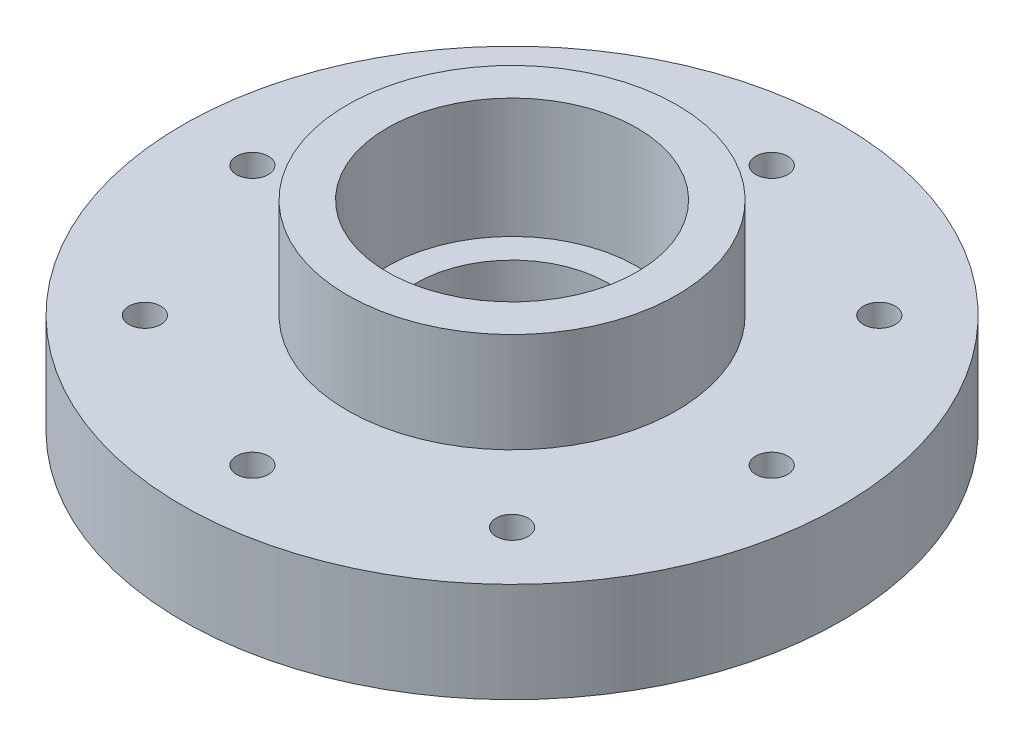
ISO-10303-21;
HEADER;
FILE_DESCRIPTION(('STEP AP214'),'2;1');
FILE_NAME('part.step','',(''),(''),'','','');
FILE_SCHEMA(('AUTOMOTIVE_DESIGN { 1 0 10303 214 1 1 1 1 }'));
ENDSEC;
DATA;
#1=APPLICATION_CONTEXT('core data for automotive mechanical design processes');
#2=APPLICATION_PROTOCOL_DEFINITION('international standard','automotive_design',2000,#1);
#3=PRODUCT_CONTEXT('',#1,'mechanical');
#4=PRODUCT('Part','Part','',(#3));
#5=PRODUCT_RELATED_PRODUCT_CATEGORY('part','',(#4));
#6=PRODUCT_DEFINITION_FORMATION('','',#4);
#7=PRODUCT_DEFINITION_CONTEXT('part definition',#1,'design');
#8=PRODUCT_DEFINITION('design','',#6,#7);
#9=PRODUCT_DEFINITION_SHAPE('','',#8);
#10=(LENGTH_UNIT() NAMED_UNIT(*) SI_UNIT(.MILLI.,.METRE.));
#11=(NAMED_UNIT(*) PLANE_ANGLE_UNIT() SI_UNIT($,.RADIAN.));
#12=(NAMED_UNIT(*) SI_UNIT($,.STERADIAN.) SOLID_ANGLE_UNIT());
#13=UNCERTAINTY_MEASURE_WITH_UNIT(LENGTH_MEASURE(1.E-05),#10,'distance_accuracy_value','');
#14=(GEOMETRIC_REPRESENTATION_CONTEXT(3) GLOBAL_UNCERTAINTY_ASSIGNED_CONTEXT((#13)) GLOBAL_UNIT_ASSIGNED_CONTEXT((#10,
#11,#12)) REPRESENTATION_CONTEXT('',''));
#15=CARTESIAN_POINT('',(0.,0.,0.));
#16=DIRECTION('',(0.,0.,1.));
#17=DIRECTION('',(1.,0.,0.));
#18=AXIS2_PLACEMENT_3D('',#15,#16,#17);
#19=CARTESIAN_POINT('',(0.,0.,0.));
#20=DIRECTION('',(0.,-1.,0.));
#21=DIRECTION('',(0.,0.,-1.));
#22=AXIS2_PLACEMENT_3D('',#19,#20,#21);
#23=CYLINDRICAL_SURFACE('',#22,82.5);
#24=CARTESIAN_POINT('',(0.,25.,0.));
#25=DIRECTION('',(0.,-1.,0.));
#26=DIRECTION('',(0.,0.,-1.));
#27=AXIS2_PLACEMENT_3D('',#24,#25,#26);
#28=CIRCLE('',#27,82.5);
#29=CARTESIAN_POINT('',(0.,25.,-82.5));
#30=VERTEX_POINT('',#29);
#31=EDGE_CURVE('E70',#30,#30,#28,.T.);
#32=ORIENTED_EDGE('',*,*,#31,.T.);
#33=EDGE_LOOP('',(#32));
#34=FACE_BOUND('',#33,.T.);
#35=CARTESIAN_POINT('',(0.,0.,0.));
#36=DIRECTION('',(0.,-1.,0.));
#37=DIRECTION('',(0.,0.,-1.));
#38=AXIS2_PLACEMENT_3D('',#35,#36,#37);
#39=CIRCLE('',#38,82.5);
#40=CARTESIAN_POINT('',(0.,0.,-82.5));
#41=VERTEX_POINT('',#40);
#42=EDGE_CURVE('E10',#41,#41,#39,.T.);
#43=ORIENTED_EDGE('',*,*,#42,.F.);
#44=EDGE_LOOP('',(#43));
#45=FACE_BOUND('',#44,.T.);
#46=ADVANCED_FACE('F31',(#34,#45),#23,.T.);
#47=CARTESIAN_POINT('',(82.5,0.,0.));
#48=DIRECTION('',(0.,-1.,0.));
#49=DIRECTION('',(0.,0.,-1.));
#50=AXIS2_PLACEMENT_3D('',#47,#48,#49);
#51=PLANE('',#50);
#52=CARTESIAN_POINT('',(65.,0.,0.));
#53=DIRECTION('',(0.,-1.,0.));
#54=DIRECTION('',(0.,0.,-1.));
#55=AXIS2_PLACEMENT_3D('',#52,#53,#54);
#56=CIRCLE('',#55,4.00000000000001);
#57=CARTESIAN_POINT('',(65.,0.,-4.00000000000004));
#58=VERTEX_POINT('',#57);
#59=EDGE_CURVE('E51',#58,#58,#56,.T.);
#60=ORIENTED_EDGE('',*,*,#59,.F.);
#61=EDGE_LOOP('',(#60));
#62=FACE_BOUND('',#61,.T.);
#63=CARTESIAN_POINT('',(45.9619407771261,0.,-45.961940777125));
#64=DIRECTION('',(0.,-1.,0.));
#65=DIRECTION('',(0.,0.,-1.));
#66=AXIS2_PLACEMENT_3D('',#63,#64,#65);
#67=CIRCLE('',#66,3.99999999999921);
#68=CARTESIAN_POINT('',(45.9619407771261,0.,-49.9619407771242));
#69=VERTEX_POINT('',#68);
#70=EDGE_CURVE('E291',#69,#69,#67,.T.);
#71=ORIENTED_EDGE('',*,*,#70,.F.);
#72=EDGE_LOOP('',(#71));
#73=FACE_BOUND('',#72,.T.);
#74=CARTESIAN_POINT('',(6.93889390390723E-13,0.,-65.));
#75=DIRECTION('',(0.,-1.,0.));
#76=DIRECTION('',(0.,0.,-1.));
#77=AXIS2_PLACEMENT_3D('',#74,#75,#76);
#78=CIRCLE('',#77,3.99999999999913);
#79=CARTESIAN_POINT('',(6.93889390390723E-13,0.,-68.9999999999991));
#80=VERTEX_POINT('',#79);
#81=EDGE_CURVE('E294',#80,#80,#78,.T.);
#82=ORIENTED_EDGE('',*,*,#81,.F.);
#83=EDGE_LOOP('',(#82));
#84=FACE_BOUND('',#83,.T.);
#85=CARTESIAN_POINT('',(-45.9619407771252,0.,-45.961940777126));
#86=DIRECTION('',(0.,-1.,0.));
#87=DIRECTION('',(0.,0.,-1.));
#88=AXIS2_PLACEMENT_3D('',#85,#86,#87);
#89=CIRCLE('',#88,3.99999999999956);
#90=CARTESIAN_POINT('',(-45.9619407771252,0.,-49.9619407771255));
#91=VERTEX_POINT('',#90);
#92=EDGE_CURVE('E299',#91,#91,#89,.T.);
#93=ORIENTED_EDGE('',*,*,#92,.F.);
#94=EDGE_LOOP('',(#93));
#95=FACE_BOUND('',#94,.T.);
#96=CARTESIAN_POINT('',(-65.,0.,0.));
#97=DIRECTION('',(0.,-1.,0.));
#98=DIRECTION('',(0.,0.,-1.));
#99=AXIS2_PLACEMENT_3D('',#96,#97,#98);
#100=CIRCLE('',#99,4.00000000000001);
#101=CARTESIAN_POINT('',(-65.,0.,-4.00000000000001));
#102=VERTEX_POINT('',#101);
#103=EDGE_CURVE('E302',#102,#102,#100,.T.);
#104=ORIENTED_EDGE('',*,*,#103,.F.);
#105=EDGE_LOOP('',(#104));
#106=FACE_BOUND('',#105,.T.);
#107=CARTESIAN_POINT('',(-45.9619407771252,0.,45.961940777126));
#108=DIRECTION('',(0.,-1.,0.));
#109=DIRECTION('',(0.,0.,-1.));
#110=AXIS2_PLACEMENT_3D('',#107,#108,#109);
#111=CIRCLE('',#110,4.00000000000002);
#112=CARTESIAN_POINT('',(-45.9619407771252,0.,41.961940777126));
#113=VERTEX_POINT('',#112);
#114=EDGE_CURVE('E305',#113,#113,#111,.T.);
#115=ORIENTED_EDGE('',*,*,#114,.F.);
#116=EDGE_LOOP('',(#115));
#117=FACE_BOUND('',#116,.T.);
#118=CARTESIAN_POINT('',(7.21644966006352E-13,0.,65.));
#119=DIRECTION('',(0.,-1.,0.));
#120=DIRECTION('',(0.,0.,-1.));
#121=AXIS2_PLACEMENT_3D('',#118,#119,#120);
#122=CIRCLE('',#121,4.00000000000002);
#123=CARTESIAN_POINT('',(7.21644966006352E-13,0.,61.));
#124=VERTEX_POINT('',#123);
#125=EDGE_CURVE('E307',#124,#124,#122,.T.);
#126=ORIENTED_EDGE('',*,*,#125,.F.);
#127=EDGE_LOOP('',(#126));
#128=FACE_BOUND('',#127,.T.);
#129=CARTESIAN_POINT('',(45.9619407771261,0.,45.961940777125));
#130=DIRECTION('',(0.,-1.,0.));
#131=DIRECTION('',(0.,0.,-1.));
#132=AXIS2_PLACEMENT_3D('',#129,#130,#131);
#133=CIRCLE('',#132,4.00000000000002);
#134=CARTESIAN_POINT('',(45.9619407771261,0.,41.961940777125));
#135=VERTEX_POINT('',#134);
#136=EDGE_CURVE('E82',#135,#135,#133,.T.);
#137=ORIENTED_EDGE('',*,*,#136,.F.);
#138=EDGE_LOOP('',(#137));
#139=FACE_BOUND('',#138,.T.);
#140=ORIENTED_EDGE('',*,*,#42,.T.);
#141=EDGE_LOOP('',(#140));
#142=FACE_BOUND('',#141,.T.);
#143=CARTESIAN_POINT('',(0.,0.,0.));
#144=DIRECTION('',(0.,-1.,0.));
#145=DIRECTION('',(0.,0.,-1.));
#146=AXIS2_PLACEMENT_3D('',#143,#144,#145);
#147=CIRCLE('',#146,56.);
#148=CARTESIAN_POINT('',(0.,0.,-56.));
#149=VERTEX_POINT('',#148);
#150=EDGE_CURVE('E38',#149,#149,#147,.T.);
#151=ORIENTED_EDGE('',*,*,#150,.F.);
#152=EDGE_LOOP('',(#151));
#153=FACE_BOUND('',#152,.T.);
#154=ADVANCED_FACE('F106',(#62,#73,#84,#95,#106,#117,#128,#139,#142,#153),#51,.T.);
#155=CARTESIAN_POINT('',(0.,0.,0.));
#156=DIRECTION('',(0.,-1.,0.));
#157=DIRECTION('',(0.,0.,-1.));
#158=AXIS2_PLACEMENT_3D('',#155,#156,#157);
#159=CYLINDRICAL_SURFACE('',#158,56.);
#160=ORIENTED_EDGE('',*,*,#150,.T.);
#161=EDGE_LOOP('',(#160));
#162=FACE_BOUND('',#161,.T.);
#163=CARTESIAN_POINT('',(0.,6.00000000000001,0.));
#164=DIRECTION('',(0.,-1.,0.));
#165=DIRECTION('',(0.,0.,-1.));
#166=AXIS2_PLACEMENT_3D('',#163,#164,#165);
#167=CIRCLE('',#166,56.);
#168=CARTESIAN_POINT('',(0.,6.00000000000001,-56.));
#169=VERTEX_POINT('',#168);
#170=EDGE_CURVE('E43',#169,#169,#167,.T.);
#171=ORIENTED_EDGE('',*,*,#170,.F.);
#172=EDGE_LOOP('',(#171));
#173=FACE_BOUND('',#172,.T.);
#174=ADVANCED_FACE('F104',(#162,#173),#159,.F.);
#175=CARTESIAN_POINT('',(56.,6.00000000000001,0.));
#176=DIRECTION('',(0.,-1.,0.));
#177=DIRECTION('',(0.,0.,-1.));
#178=AXIS2_PLACEMENT_3D('',#175,#176,#177);
#179=PLANE('',#178);
#180=ORIENTED_EDGE('',*,*,#170,.T.);
#181=EDGE_LOOP('',(#180));
#182=FACE_BOUND('',#181,.T.);
#183=CARTESIAN_POINT('',(0.,6.,0.));
#184=DIRECTION('',(0.,-1.,0.));
#185=DIRECTION('',(0.,0.,-1.));
#186=AXIS2_PLACEMENT_3D('',#183,#184,#185);
#187=CIRCLE('',#186,24.);
#188=CARTESIAN_POINT('',(0.,6.,-24.));
#189=VERTEX_POINT('',#188);
#190=EDGE_CURVE('E96',#189,#189,#187,.T.);
#191=ORIENTED_EDGE('',*,*,#190,.F.);
#192=EDGE_LOOP('',(#191));
#193=FACE_BOUND('',#192,.T.);
#194=ADVANCED_FACE('F101',(#182,#193),#179,.T.);
#195=CARTESIAN_POINT('',(0.,0.,0.));
#196=DIRECTION('',(0.,-1.,0.));
#197=DIRECTION('',(0.,0.,-1.));
#198=AXIS2_PLACEMENT_3D('',#195,#196,#197);
#199=CYLINDRICAL_SURFACE('',#198,24.);
#200=ORIENTED_EDGE('',*,*,#190,.T.);
#201=EDGE_LOOP('',(#200));
#202=FACE_BOUND('',#201,.T.);
#203=CARTESIAN_POINT('',(0.,20.,0.));
#204=DIRECTION('',(0.,-1.,0.));
#205=DIRECTION('',(0.,0.,-1.));
#206=AXIS2_PLACEMENT_3D('',#203,#204,#205);
#207=CIRCLE('',#206,24.);
#208=CARTESIAN_POINT('',(0.,20.,-24.));
#209=VERTEX_POINT('',#208);
#210=EDGE_CURVE('E93',#209,#209,#207,.T.);
#211=ORIENTED_EDGE('',*,*,#210,.F.);
#212=EDGE_LOOP('',(#211));
#213=FACE_BOUND('',#212,.T.);
#214=ADVANCED_FACE('F113',(#202,#213),#199,.F.);
#215=CARTESIAN_POINT('',(24.,20.,0.));
#216=DIRECTION('',(0.,1.,0.));
#217=DIRECTION('',(0.,0.,1.));
#218=AXIS2_PLACEMENT_3D('',#215,#216,#217);
#219=PLANE('',#218);
#220=ORIENTED_EDGE('',*,*,#210,.T.);
#221=EDGE_LOOP('',(#220));
#222=FACE_BOUND('',#221,.T.);
#223=CARTESIAN_POINT('',(0.,20.,0.));
#224=DIRECTION('',(0.,-1.,0.));
#225=DIRECTION('',(0.,0.,-1.));
#226=AXIS2_PLACEMENT_3D('',#223,#224,#225);
#227=CIRCLE('',#226,31.2564621680309);
#228=CARTESIAN_POINT('',(0.,20.,-31.2564621680309));
#229=VERTEX_POINT('',#228);
#230=EDGE_CURVE('E90',#229,#229,#227,.T.);
#231=ORIENTED_EDGE('',*,*,#230,.F.);
#232=EDGE_LOOP('',(#231));
#233=FACE_BOUND('',#232,.T.);
#234=ADVANCED_FACE('F234',(#222,#233),#219,.T.);
#235=CARTESIAN_POINT('',(0.,0.,0.));
#236=DIRECTION('',(0.,-1.,0.));
#237=DIRECTION('',(0.,0.,-1.));
#238=AXIS2_PLACEMENT_3D('',#235,#236,#237);
#239=CYLINDRICAL_SURFACE('',#238,31.2564621680309);
#240=ORIENTED_EDGE('',*,*,#230,.T.);
#241=EDGE_LOOP('',(#240));
#242=FACE_BOUND('',#241,.T.);
#243=CARTESIAN_POINT('',(0.,50.,0.));
#244=DIRECTION('',(0.,-1.,0.));
#245=DIRECTION('',(0.,0.,-1.));
#246=AXIS2_PLACEMENT_3D('',#243,#244,#245);
#247=CIRCLE('',#246,31.2564621680309);
#248=CARTESIAN_POINT('',(0.,50.,-31.2564621680309));
#249=VERTEX_POINT('',#248);
#250=EDGE_CURVE('E87',#249,#249,#247,.T.);
#251=ORIENTED_EDGE('',*,*,#250,.F.);
#252=EDGE_LOOP('',(#251));
#253=FACE_BOUND('',#252,.T.);
#254=ADVANCED_FACE('F230',(#242,#253),#239,.F.);
#255=CARTESIAN_POINT('',(31.2564621680309,50.,0.));
#256=DIRECTION('',(0.,1.,0.));
#257=DIRECTION('',(0.,0.,1.));
#258=AXIS2_PLACEMENT_3D('',#255,#256,#257);
#259=PLANE('',#258);
#260=ORIENTED_EDGE('',*,*,#250,.T.);
#261=EDGE_LOOP('',(#260));
#262=FACE_BOUND('',#261,.T.);
#263=CARTESIAN_POINT('',(0.,50.,0.));
#264=DIRECTION('',(0.,-1.,0.));
#265=DIRECTION('',(0.,0.,-1.));
#266=AXIS2_PLACEMENT_3D('',#263,#264,#265);
#267=CIRCLE('',#266,41.2564621680309);
#268=CARTESIAN_POINT('',(0.,50.,-41.2564621680309));
#269=VERTEX_POINT('',#268);
#270=EDGE_CURVE('E79',#269,#269,#267,.T.);
#271=ORIENTED_EDGE('',*,*,#270,.F.);
#272=EDGE_LOOP('',(#271));
#273=FACE_BOUND('',#272,.T.);
#274=ADVANCED_FACE('F226',(#262,#273),#259,.T.);
#275=CARTESIAN_POINT('',(0.,0.,0.));
#276=DIRECTION('',(0.,-1.,0.));
#277=DIRECTION('',(0.,0.,-1.));
#278=AXIS2_PLACEMENT_3D('',#275,#276,#277);
#279=CYLINDRICAL_SURFACE('',#278,41.2564621680309);
#280=ORIENTED_EDGE('',*,*,#270,.T.);
#281=EDGE_LOOP('',(#280));
#282=FACE_BOUND('',#281,.T.);
#283=CARTESIAN_POINT('',(0.,25.,0.));
#284=DIRECTION('',(0.,-1.,0.));
#285=DIRECTION('',(0.,0.,-1.));
#286=AXIS2_PLACEMENT_3D('',#283,#284,#285);
#287=CIRCLE('',#286,41.2564621680309);
#288=CARTESIAN_POINT('',(0.,25.,-41.2564621680309));
#289=VERTEX_POINT('',#288);
#290=EDGE_CURVE('E74',#289,#289,#287,.T.);
#291=ORIENTED_EDGE('',*,*,#290,.F.);
#292=EDGE_LOOP('',(#291));
#293=FACE_BOUND('',#292,.T.);
#294=ADVANCED_FACE('F131',(#282,#293),#279,.T.);
#295=CARTESIAN_POINT('',(82.5,25.,0.));
#296=DIRECTION('',(0.,1.,0.));
#297=DIRECTION('',(0.,0.,1.));
#298=AXIS2_PLACEMENT_3D('',#295,#296,#297);
#299=PLANE('',#298);
#300=CARTESIAN_POINT('',(65.,25.,0.));
#301=DIRECTION('',(0.,1.,0.));
#302=DIRECTION('',(0.,0.,1.));
#303=AXIS2_PLACEMENT_3D('',#300,#301,#302);
#304=CIRCLE('',#303,4.00000000000001);
#305=CARTESIAN_POINT('',(65.,25.,3.99999999999999));
#306=VERTEX_POINT('',#305);
#307=EDGE_CURVE('E34',#306,#306,#304,.T.);
#308=ORIENTED_EDGE('',*,*,#307,.F.);
#309=EDGE_LOOP('',(#308));
#310=FACE_BOUND('',#309,.T.);
#311=CARTESIAN_POINT('',(45.9619407771261,25.,-45.961940777125));
#312=DIRECTION('',(0.,1.,0.));
#313=DIRECTION('',(0.,0.,1.));
#314=AXIS2_PLACEMENT_3D('',#311,#312,#313);
#315=CIRCLE('',#314,3.99999999999921);
#316=CARTESIAN_POINT('',(45.9619407771261,25.,-41.9619407771258));
#317=VERTEX_POINT('',#316);
#318=EDGE_CURVE('E65',#317,#317,#315,.T.);
#319=ORIENTED_EDGE('',*,*,#318,.F.);
#320=EDGE_LOOP('',(#319));
#321=FACE_BOUND('',#320,.T.);
#322=CARTESIAN_POINT('',(6.93889390390723E-13,25.,-65.));
#323=DIRECTION('',(0.,1.,0.));
#324=DIRECTION('',(0.,0.,1.));
#325=AXIS2_PLACEMENT_3D('',#322,#323,#324);
#326=CIRCLE('',#325,3.99999999999913);
#327=CARTESIAN_POINT('',(6.93889390390723E-13,25.,-61.0000000000009));
#328=VERTEX_POINT('',#327);
#329=EDGE_CURVE('E63',#328,#328,#326,.T.);
#330=ORIENTED_EDGE('',*,*,#329,.F.);
#331=EDGE_LOOP('',(#330));
#332=FACE_BOUND('',#331,.T.);
#333=CARTESIAN_POINT('',(-45.9619407771252,25.,-45.961940777126));
#334=DIRECTION('',(0.,1.,0.));
#335=DIRECTION('',(0.,0.,1.));
#336=AXIS2_PLACEMENT_3D('',#333,#334,#335);
#337=CIRCLE('',#336,3.99999999999956);
#338=CARTESIAN_POINT('',(-45.9619407771252,25.,-41.9619407771264));
#339=VERTEX_POINT('',#338);
#340=EDGE_CURVE('E60',#339,#339,#337,.T.);
#341=ORIENTED_EDGE('',*,*,#340,.F.);
#342=EDGE_LOOP('',(#341));
#343=FACE_BOUND('',#342,.T.);
#344=CARTESIAN_POINT('',(-65.,25.,0.));
#345=DIRECTION('',(0.,1.,0.));
#346=DIRECTION('',(0.,0.,1.));
#347=AXIS2_PLACEMENT_3D('',#344,#345,#346);
#348=CIRCLE('',#347,4.00000000000001);
#349=CARTESIAN_POINT('',(-65.,25.,4.00000000000001));
#350=VERTEX_POINT('',#349);
#351=EDGE_CURVE('E57',#350,#350,#348,.T.);
#352=ORIENTED_EDGE('',*,*,#351,.F.);
#353=EDGE_LOOP('',(#352));
#354=FACE_BOUND('',#353,.T.);
#355=CARTESIAN_POINT('',(-45.9619407771252,25.,45.961940777126));
#356=DIRECTION('',(0.,1.,0.));
#357=DIRECTION('',(0.,0.,1.));
#358=AXIS2_PLACEMENT_3D('',#355,#356,#357);
#359=CIRCLE('',#358,4.00000000000002);
#360=CARTESIAN_POINT('',(-45.9619407771252,25.,49.961940777126));
#361=VERTEX_POINT('',#360);
#362=EDGE_CURVE('E54',#361,#361,#359,.T.);
#363=ORIENTED_EDGE('',*,*,#362,.F.);
#364=EDGE_LOOP('',(#363));
#365=FACE_BOUND('',#364,.T.);
#366=CARTESIAN_POINT('',(7.21644966006352E-13,25.,65.));
#367=DIRECTION('',(0.,1.,0.));
#368=DIRECTION('',(0.,0.,1.));
#369=AXIS2_PLACEMENT_3D('',#366,#367,#368);
#370=CIRCLE('',#369,4.00000000000002);
#371=CARTESIAN_POINT('',(7.21644966006352E-13,25.,69.));
#372=VERTEX_POINT('',#371);
#373=EDGE_CURVE('E50',#372,#372,#370,.T.);
#374=ORIENTED_EDGE('',*,*,#373,.F.);
#375=EDGE_LOOP('',(#374));
#376=FACE_BOUND('',#375,.T.);
#377=CARTESIAN_POINT('',(45.9619407771261,25.,45.961940777125));
#378=DIRECTION('',(0.,1.,0.));
#379=DIRECTION('',(0.,0.,1.));
#380=AXIS2_PLACEMENT_3D('',#377,#378,#379);
#381=CIRCLE('',#380,4.00000000000002);
#382=CARTESIAN_POINT('',(45.9619407771261,25.,49.961940777125));
#383=VERTEX_POINT('',#382);
#384=EDGE_CURVE('E47',#383,#383,#381,.T.);
#385=ORIENTED_EDGE('',*,*,#384,.F.);
#386=EDGE_LOOP('',(#385));
#387=FACE_BOUND('',#386,.T.);
#388=ORIENTED_EDGE('',*,*,#290,.T.);
#389=EDGE_LOOP('',(#388));
#390=FACE_BOUND('',#389,.T.);
#391=ORIENTED_EDGE('',*,*,#31,.F.);
#392=EDGE_LOOP('',(#391));
#393=FACE_BOUND('',#392,.T.);
#394=ADVANCED_FACE('F136',(#310,#321,#332,#343,#354,#365,#376,#387,#390,#393),#299,.T.);
#395=CARTESIAN_POINT('',(45.9619407771261,50.,45.961940777125));
#396=DIRECTION('',(0.,-1.,0.));
#397=DIRECTION('',(0.,0.,-1.));
#398=AXIS2_PLACEMENT_3D('',#395,#396,#397);
#399=CYLINDRICAL_SURFACE('',#398,4.00000000000002);
#400=ORIENTED_EDGE('',*,*,#384,.T.);
#401=EDGE_LOOP('',(#400));
#402=FACE_BOUND('',#401,.T.);
#403=ORIENTED_EDGE('',*,*,#136,.T.);
#404=EDGE_LOOP('',(#403));
#405=FACE_BOUND('',#404,.T.);
#406=ADVANCED_FACE('F141',(#402,#405),#399,.F.);
#407=CARTESIAN_POINT('',(7.21644966006352E-13,50.,65.));
#408=DIRECTION('',(0.,-1.,0.));
#409=DIRECTION('',(0.,0.,-1.));
#410=AXIS2_PLACEMENT_3D('',#407,#408,#409);
#411=CYLINDRICAL_SURFACE('',#410,4.00000000000002);
#412=ORIENTED_EDGE('',*,*,#373,.T.);
#413=EDGE_LOOP('',(#412));
#414=FACE_BOUND('',#413,.T.);
#415=ORIENTED_EDGE('',*,*,#125,.T.);
#416=EDGE_LOOP('',(#415));
#417=FACE_BOUND('',#416,.T.);
#418=ADVANCED_FACE('F151',(#414,#417),#411,.F.);
#419=CARTESIAN_POINT('',(-45.9619407771252,50.,45.961940777126));
#420=DIRECTION('',(0.,-1.,0.));
#421=DIRECTION('',(0.,0.,-1.));
#422=AXIS2_PLACEMENT_3D('',#419,#420,#421);
#423=CYLINDRICAL_SURFACE('',#422,4.00000000000002);
#424=ORIENTED_EDGE('',*,*,#362,.T.);
#425=EDGE_LOOP('',(#424));
#426=FACE_BOUND('',#425,.T.);
#427=ORIENTED_EDGE('',*,*,#114,.T.);
#428=EDGE_LOOP('',(#427));
#429=FACE_BOUND('',#428,.T.);
#430=ADVANCED_FACE('F161',(#426,#429),#423,.F.);
#431=CARTESIAN_POINT('',(-65.,50.,0.));
#432=DIRECTION('',(0.,-1.,0.));
#433=DIRECTION('',(0.,0.,-1.));
#434=AXIS2_PLACEMENT_3D('',#431,#432,#433);
#435=CYLINDRICAL_SURFACE('',#434,4.00000000000001);
#436=ORIENTED_EDGE('',*,*,#351,.T.);
#437=EDGE_LOOP('',(#436));
#438=FACE_BOUND('',#437,.T.);
#439=ORIENTED_EDGE('',*,*,#103,.T.);
#440=EDGE_LOOP('',(#439));
#441=FACE_BOUND('',#440,.T.);
#442=ADVANCED_FACE('F171',(#438,#441),#435,.F.);
#443=CARTESIAN_POINT('',(-45.9619407771252,50.,-45.961940777126));
#444=DIRECTION('',(0.,-1.,0.));
#445=DIRECTION('',(0.,0.,-1.));
#446=AXIS2_PLACEMENT_3D('',#443,#444,#445);
#447=CYLINDRICAL_SURFACE('',#446,3.99999999999956);
#448=ORIENTED_EDGE('',*,*,#340,.T.);
#449=EDGE_LOOP('',(#448));
#450=FACE_BOUND('',#449,.T.);
#451=ORIENTED_EDGE('',*,*,#92,.T.);
#452=EDGE_LOOP('',(#451));
#453=FACE_BOUND('',#452,.T.);
#454=ADVANCED_FACE('F181',(#450,#453),#447,.F.);
#455=CARTESIAN_POINT('',(6.93889390390723E-13,50.,-65.));
#456=DIRECTION('',(0.,-1.,0.));
#457=DIRECTION('',(0.,0.,-1.));
#458=AXIS2_PLACEMENT_3D('',#455,#456,#457);
#459=CYLINDRICAL_SURFACE('',#458,3.99999999999913);
#460=ORIENTED_EDGE('',*,*,#329,.T.);
#461=EDGE_LOOP('',(#460));
#462=FACE_BOUND('',#461,.T.);
#463=ORIENTED_EDGE('',*,*,#81,.T.);
#464=EDGE_LOOP('',(#463));
#465=FACE_BOUND('',#464,.T.);
#466=ADVANCED_FACE('F191',(#462,#465),#459,.F.);
#467=CARTESIAN_POINT('',(45.9619407771261,50.,-45.961940777125));
#468=DIRECTION('',(0.,-1.,0.));
#469=DIRECTION('',(0.,0.,-1.));
#470=AXIS2_PLACEMENT_3D('',#467,#468,#469);
#471=CYLINDRICAL_SURFACE('',#470,3.99999999999921);
#472=ORIENTED_EDGE('',*,*,#318,.T.);
#473=EDGE_LOOP('',(#472));
#474=FACE_BOUND('',#473,.T.);
#475=ORIENTED_EDGE('',*,*,#70,.T.);
#476=EDGE_LOOP('',(#475));
#477=FACE_BOUND('',#476,.T.);
#478=ADVANCED_FACE('F201',(#474,#477),#471,.F.);
#479=CARTESIAN_POINT('',(65.,50.,0.));
#480=DIRECTION('',(0.,-1.,0.));
#481=DIRECTION('',(0.,0.,-1.));
#482=AXIS2_PLACEMENT_3D('',#479,#480,#481);
#483=CYLINDRICAL_SURFACE('',#482,4.00000000000001);
#484=ORIENTED_EDGE('',*,*,#307,.T.);
#485=EDGE_LOOP('',(#484));
#486=FACE_BOUND('',#485,.T.);
#487=ORIENTED_EDGE('',*,*,#59,.T.);
#488=EDGE_LOOP('',(#487));
#489=FACE_BOUND('',#488,.T.);
#490=ADVANCED_FACE('F211',(#486,#489),#483,.F.);
#491=CLOSED_SHELL('',(#46,#154,#174,#194,#214,#234,#254,#274,#294,#394,#406,#418,#430,#442,#454,
#466,#478,#490));
#492=MANIFOLD_SOLID_BREP('B2',#491);
#493=ADVANCED_BREP_SHAPE_REPRESENTATION('',(#18,#492),#14);
#494=SHAPE_DEFINITION_REPRESENTATION(#9,#493);
ENDSEC;
END-ISO-10303-21;
